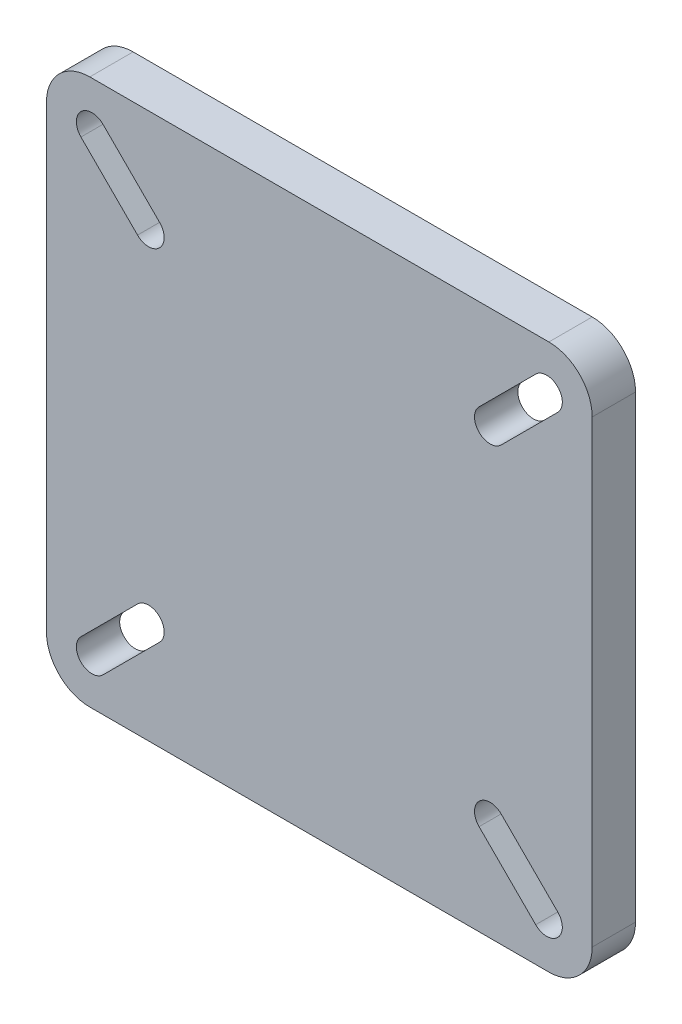
ISO-10303-21;
HEADER;
FILE_DESCRIPTION(('STEP AP214'),'2;1');
FILE_NAME('part.step','',(''),(''),'','','');
FILE_SCHEMA(('AUTOMOTIVE_DESIGN { 1 0 10303 214 1 1 1 1 }'));
ENDSEC;
DATA;
#1=APPLICATION_CONTEXT('core data for automotive mechanical design processes');
#2=APPLICATION_PROTOCOL_DEFINITION('international standard','automotive_design',2000,#1);
#3=PRODUCT_CONTEXT('',#1,'mechanical');
#4=PRODUCT('Part','Part','',(#3));
#5=PRODUCT_RELATED_PRODUCT_CATEGORY('part','',(#4));
#6=PRODUCT_DEFINITION_FORMATION('','',#4);
#7=PRODUCT_DEFINITION_CONTEXT('part definition',#1,'design');
#8=PRODUCT_DEFINITION('design','',#6,#7);
#9=PRODUCT_DEFINITION_SHAPE('','',#8);
#10=(LENGTH_UNIT() NAMED_UNIT(*) SI_UNIT(.MILLI.,.METRE.));
#11=(NAMED_UNIT(*) PLANE_ANGLE_UNIT() SI_UNIT($,.RADIAN.));
#12=(NAMED_UNIT(*) SI_UNIT($,.STERADIAN.) SOLID_ANGLE_UNIT());
#13=UNCERTAINTY_MEASURE_WITH_UNIT(LENGTH_MEASURE(1.E-05),#10,'distance_accuracy_value','');
#14=(GEOMETRIC_REPRESENTATION_CONTEXT(3) GLOBAL_UNCERTAINTY_ASSIGNED_CONTEXT((#13)) GLOBAL_UNIT_ASSIGNED_CONTEXT((#10,
#11,#12)) REPRESENTATION_CONTEXT('',''));
#15=CARTESIAN_POINT('',(0.,0.,0.));
#16=DIRECTION('',(0.,0.,1.));
#17=DIRECTION('',(1.,0.,0.));
#18=AXIS2_PLACEMENT_3D('',#15,#16,#17);
#19=CARTESIAN_POINT('',(60.,-60.,9.525));
#20=DIRECTION('',(-1.,0.,0.));
#21=DIRECTION('',(0.,0.,1.));
#22=AXIS2_PLACEMENT_3D('',#19,#20,#21);
#23=PLANE('',#22);
#24=DIRECTION('',(0.,1.,0.));
#25=VECTOR('',#24,1.);
#26=CARTESIAN_POINT('',(60.,-60.,9.525));
#27=LINE('',#26,#25);
#28=CARTESIAN_POINT('',(60.,-50.475,9.525));
#29=VERTEX_POINT('',#28);
#30=CARTESIAN_POINT('',(60.,50.475,9.525));
#31=VERTEX_POINT('',#30);
#32=EDGE_CURVE('E315',#29,#31,#27,.T.);
#33=ORIENTED_EDGE('',*,*,#32,.F.);
#34=DIRECTION('',(0.,0.,-1.));
#35=VECTOR('',#34,1.);
#36=CARTESIAN_POINT('',(60.,-50.475,9.525));
#37=LINE('',#36,#35);
#38=CARTESIAN_POINT('',(60.,-50.475,0.));
#39=VERTEX_POINT('',#38);
#40=EDGE_CURVE('E370',#29,#39,#37,.T.);
#41=ORIENTED_EDGE('',*,*,#40,.T.);
#42=DIRECTION('',(0.,1.,0.));
#43=VECTOR('',#42,1.);
#44=CARTESIAN_POINT('',(60.,-60.,0.));
#45=LINE('',#44,#43);
#46=CARTESIAN_POINT('',(60.,50.475,0.));
#47=VERTEX_POINT('',#46);
#48=EDGE_CURVE('E327',#39,#47,#45,.T.);
#49=ORIENTED_EDGE('',*,*,#48,.T.);
#50=DIRECTION('',(0.,0.,-1.));
#51=VECTOR('',#50,1.);
#52=CARTESIAN_POINT('',(60.,50.475,9.525));
#53=LINE('',#52,#51);
#54=EDGE_CURVE('E326',#47,#31,#53,.F.);
#55=ORIENTED_EDGE('',*,*,#54,.T.);
#56=EDGE_LOOP('',(#33,#41,#49,#55));
#57=FACE_BOUND('',#56,.T.);
#58=ADVANCED_FACE('F47',(#57),#23,.F.);
#59=CARTESIAN_POINT('',(-60.,60.,9.525));
#60=DIRECTION('',(0.,-1.,0.));
#61=DIRECTION('',(0.,0.,-1.));
#62=AXIS2_PLACEMENT_3D('',#59,#60,#61);
#63=PLANE('',#62);
#64=DIRECTION('',(-1.,0.,0.));
#65=VECTOR('',#64,1.);
#66=CARTESIAN_POINT('',(-60.,60.,9.525));
#67=LINE('',#66,#65);
#68=CARTESIAN_POINT('',(50.475,60.,9.525));
#69=VERTEX_POINT('',#68);
#70=CARTESIAN_POINT('',(-50.475,60.,9.525));
#71=VERTEX_POINT('',#70);
#72=EDGE_CURVE('E318',#69,#71,#67,.T.);
#73=ORIENTED_EDGE('',*,*,#72,.F.);
#74=DIRECTION('',(0.,0.,-1.));
#75=VECTOR('',#74,1.);
#76=CARTESIAN_POINT('',(50.475,60.,9.525));
#77=LINE('',#76,#75);
#78=CARTESIAN_POINT('',(50.475,60.,0.));
#79=VERTEX_POINT('',#78);
#80=EDGE_CURVE('E395',#69,#79,#77,.T.);
#81=ORIENTED_EDGE('',*,*,#80,.T.);
#82=DIRECTION('',(-1.,0.,0.));
#83=VECTOR('',#82,1.);
#84=CARTESIAN_POINT('',(-60.,60.,0.));
#85=LINE('',#84,#83);
#86=CARTESIAN_POINT('',(-50.475,60.,0.));
#87=VERTEX_POINT('',#86);
#88=EDGE_CURVE('E330',#79,#87,#85,.T.);
#89=ORIENTED_EDGE('',*,*,#88,.T.);
#90=DIRECTION('',(0.,0.,-1.));
#91=VECTOR('',#90,1.);
#92=CARTESIAN_POINT('',(-50.475,60.,9.525));
#93=LINE('',#92,#91);
#94=EDGE_CURVE('E393',#87,#71,#93,.F.);
#95=ORIENTED_EDGE('',*,*,#94,.T.);
#96=EDGE_LOOP('',(#73,#81,#89,#95));
#97=FACE_BOUND('',#96,.T.);
#98=ADVANCED_FACE('F428',(#97),#63,.F.);
#99=CARTESIAN_POINT('',(-60.,-60.,9.525));
#100=DIRECTION('',(1.,0.,0.));
#101=DIRECTION('',(0.,0.,-1.));
#102=AXIS2_PLACEMENT_3D('',#99,#100,#101);
#103=PLANE('',#102);
#104=DIRECTION('',(0.,-1.,0.));
#105=VECTOR('',#104,1.);
#106=CARTESIAN_POINT('',(-60.,-60.,0.));
#107=LINE('',#106,#105);
#108=CARTESIAN_POINT('',(-60.,50.475,0.));
#109=VERTEX_POINT('',#108);
#110=CARTESIAN_POINT('',(-60.,-50.475,0.));
#111=VERTEX_POINT('',#110);
#112=EDGE_CURVE('E334',#109,#111,#107,.T.);
#113=ORIENTED_EDGE('',*,*,#112,.T.);
#114=DIRECTION('',(0.,0.,-1.));
#115=VECTOR('',#114,1.);
#116=CARTESIAN_POINT('',(-60.,-50.475,9.525));
#117=LINE('',#116,#115);
#118=CARTESIAN_POINT('',(-60.,-50.475,9.525));
#119=VERTEX_POINT('',#118);
#120=EDGE_CURVE('E13',#111,#119,#117,.F.);
#121=ORIENTED_EDGE('',*,*,#120,.T.);
#122=DIRECTION('',(0.,-1.,0.));
#123=VECTOR('',#122,1.);
#124=CARTESIAN_POINT('',(-60.,-60.,9.525));
#125=LINE('',#124,#123);
#126=CARTESIAN_POINT('',(-60.,50.475,9.525));
#127=VERTEX_POINT('',#126);
#128=EDGE_CURVE('E321',#127,#119,#125,.T.);
#129=ORIENTED_EDGE('',*,*,#128,.F.);
#130=DIRECTION('',(0.,0.,-1.));
#131=VECTOR('',#130,1.);
#132=CARTESIAN_POINT('',(-60.,50.475,9.525));
#133=LINE('',#132,#131);
#134=EDGE_CURVE('E55',#127,#109,#133,.T.);
#135=ORIENTED_EDGE('',*,*,#134,.T.);
#136=EDGE_LOOP('',(#113,#121,#129,#135));
#137=FACE_BOUND('',#136,.T.);
#138=ADVANCED_FACE('F400',(#137),#103,.F.);
#139=CARTESIAN_POINT('',(-60.,-60.,9.525));
#140=DIRECTION('',(0.,1.,0.));
#141=DIRECTION('',(0.,0.,1.));
#142=AXIS2_PLACEMENT_3D('',#139,#140,#141);
#143=PLANE('',#142);
#144=DIRECTION('',(1.,0.,0.));
#145=VECTOR('',#144,1.);
#146=CARTESIAN_POINT('',(-60.,-60.,0.));
#147=LINE('',#146,#145);
#148=CARTESIAN_POINT('',(-50.475,-60.,0.));
#149=VERTEX_POINT('',#148);
#150=CARTESIAN_POINT('',(50.475,-60.,0.));
#151=VERTEX_POINT('',#150);
#152=EDGE_CURVE('E319',#149,#151,#147,.T.);
#153=ORIENTED_EDGE('',*,*,#152,.T.);
#154=DIRECTION('',(0.,0.,-1.));
#155=VECTOR('',#154,1.);
#156=CARTESIAN_POINT('',(50.475,-60.,9.525));
#157=LINE('',#156,#155);
#158=CARTESIAN_POINT('',(50.475,-60.,9.525));
#159=VERTEX_POINT('',#158);
#160=EDGE_CURVE('E384',#151,#159,#157,.F.);
#161=ORIENTED_EDGE('',*,*,#160,.T.);
#162=DIRECTION('',(1.,0.,0.));
#163=VECTOR('',#162,1.);
#164=CARTESIAN_POINT('',(-60.,-60.,9.525));
#165=LINE('',#164,#163);
#166=CARTESIAN_POINT('',(-50.475,-60.,9.525));
#167=VERTEX_POINT('',#166);
#168=EDGE_CURVE('E323',#167,#159,#165,.T.);
#169=ORIENTED_EDGE('',*,*,#168,.F.);
#170=DIRECTION('',(0.,0.,-1.));
#171=VECTOR('',#170,1.);
#172=CARTESIAN_POINT('',(-50.475,-60.,9.525));
#173=LINE('',#172,#171);
#174=EDGE_CURVE('E381',#167,#149,#173,.T.);
#175=ORIENTED_EDGE('',*,*,#174,.T.);
#176=EDGE_LOOP('',(#153,#161,#169,#175));
#177=FACE_BOUND('',#176,.T.);
#178=ADVANCED_FACE('F412',(#177),#143,.F.);
#179=CARTESIAN_POINT('',(0.,0.,9.525));
#180=DIRECTION('',(0.,0.,-1.));
#181=DIRECTION('',(-1.,0.,0.));
#182=AXIS2_PLACEMENT_3D('',#179,#180,#181);
#183=PLANE('',#182);
#184=DIRECTION('',(0.707106781186546,0.707106781186549,0.));
#185=VECTOR('',#184,1.);
#186=CARTESIAN_POINT('',(-47.5753308473112,-52.4246691526888,9.525));
#187=LINE('',#186,#185);
#188=CARTESIAN_POINT('',(-47.5753308473112,-52.4246691526888,9.525));
#189=VERTEX_POINT('',#188);
#190=CARTESIAN_POINT('',(-35.1253308473112,-39.9746691526888,9.525));
#191=VERTEX_POINT('',#190);
#192=EDGE_CURVE('E362',#189,#191,#187,.T.);
#193=ORIENTED_EDGE('',*,*,#192,.F.);
#194=CARTESIAN_POINT('',(-49.9999999999998,-50.0000000000002,9.525));
#195=DIRECTION('',(0.,0.,1.));
#196=DIRECTION('',(1.,0.,0.));
#197=AXIS2_PLACEMENT_3D('',#194,#195,#196);
#198=CIRCLE('',#197,3.42899999999999);
#199=CARTESIAN_POINT('',(-52.4246691526885,-47.5753308473115,9.525));
#200=VERTEX_POINT('',#199);
#201=EDGE_CURVE('E216',#200,#189,#198,.T.);
#202=ORIENTED_EDGE('',*,*,#201,.F.);
#203=DIRECTION('',(-0.707106781186544,-0.707106781186551,0.));
#204=VECTOR('',#203,1.);
#205=CARTESIAN_POINT('',(-52.4246691526885,-47.5753308473115,9.525));
#206=LINE('',#205,#204);
#207=CARTESIAN_POINT('',(-39.9746691526886,-35.1253308473115,9.525));
#208=VERTEX_POINT('',#207);
#209=EDGE_CURVE('E366',#208,#200,#206,.T.);
#210=ORIENTED_EDGE('',*,*,#209,.F.);
#211=CARTESIAN_POINT('',(-37.5499999999999,-37.5500000000001,9.525));
#212=DIRECTION('',(0.,0.,1.));
#213=DIRECTION('',(1.,0.,0.));
#214=AXIS2_PLACEMENT_3D('',#211,#212,#213);
#215=CIRCLE('',#214,3.42900000000001);
#216=EDGE_CURVE('E364',#191,#208,#215,.T.);
#217=ORIENTED_EDGE('',*,*,#216,.F.);
#218=EDGE_LOOP('',(#193,#202,#210,#217));
#219=FACE_BOUND('',#218,.T.);
#220=DIRECTION('',(-0.707106781186547,0.707106781186548,0.));
#221=VECTOR('',#220,1.);
#222=CARTESIAN_POINT('',(52.4246691526887,-47.5753308473113,9.525));
#223=LINE('',#222,#221);
#224=CARTESIAN_POINT('',(52.4246691526887,-47.5753308473113,9.525));
#225=VERTEX_POINT('',#224);
#226=CARTESIAN_POINT('',(39.9746691526887,-35.1253308473113,9.525));
#227=VERTEX_POINT('',#226);
#228=EDGE_CURVE('E353',#225,#227,#223,.T.);
#229=ORIENTED_EDGE('',*,*,#228,.F.);
#230=CARTESIAN_POINT('',(50.,-50.,9.525));
#231=DIRECTION('',(0.,0.,1.));
#232=DIRECTION('',(1.,0.,0.));
#233=AXIS2_PLACEMENT_3D('',#230,#231,#232);
#234=CIRCLE('',#233,3.42899999999999);
#235=CARTESIAN_POINT('',(47.5753308473113,-52.4246691526887,9.525));
#236=VERTEX_POINT('',#235);
#237=EDGE_CURVE('E359',#236,#225,#234,.T.);
#238=ORIENTED_EDGE('',*,*,#237,.F.);
#239=DIRECTION('',(0.707106781186548,-0.707106781186547,0.));
#240=VECTOR('',#239,1.);
#241=CARTESIAN_POINT('',(47.5753308473113,-52.4246691526887,9.525));
#242=LINE('',#241,#240);
#243=CARTESIAN_POINT('',(35.1253308473113,-39.9746691526887,9.525));
#244=VERTEX_POINT('',#243);
#245=EDGE_CURVE('E357',#244,#236,#242,.T.);
#246=ORIENTED_EDGE('',*,*,#245,.F.);
#247=CARTESIAN_POINT('',(37.55,-37.55,9.525));
#248=DIRECTION('',(0.,0.,1.));
#249=DIRECTION('',(1.,0.,0.));
#250=AXIS2_PLACEMENT_3D('',#247,#248,#249);
#251=CIRCLE('',#250,3.42900000000001);
#252=EDGE_CURVE('E355',#227,#244,#251,.T.);
#253=ORIENTED_EDGE('',*,*,#252,.F.);
#254=EDGE_LOOP('',(#229,#238,#246,#253));
#255=FACE_BOUND('',#254,.T.);
#256=DIRECTION('',(-0.707106781186541,-0.707106781186554,0.));
#257=VECTOR('',#256,1.);
#258=CARTESIAN_POINT('',(47.5753308473108,52.4246691526892,9.525));
#259=LINE('',#258,#257);
#260=CARTESIAN_POINT('',(47.5753308473108,52.4246691526892,9.525));
#261=VERTEX_POINT('',#260);
#262=CARTESIAN_POINT('',(35.1253308473109,39.974669152689,9.525));
#263=VERTEX_POINT('',#262);
#264=EDGE_CURVE('E246',#261,#263,#259,.T.);
#265=ORIENTED_EDGE('',*,*,#264,.F.);
#266=CARTESIAN_POINT('',(49.9999999999995,50.0000000000005,9.525));
#267=DIRECTION('',(0.,0.,1.));
#268=DIRECTION('',(1.,0.,0.));
#269=AXIS2_PLACEMENT_3D('',#266,#267,#268);
#270=CIRCLE('',#269,3.42899999999999);
#271=CARTESIAN_POINT('',(52.4246691526882,47.5753308473119,9.525));
#272=VERTEX_POINT('',#271);
#273=EDGE_CURVE('E350',#272,#261,#270,.T.);
#274=ORIENTED_EDGE('',*,*,#273,.F.);
#275=DIRECTION('',(0.707106781186539,0.707106781186556,0.));
#276=VECTOR('',#275,1.);
#277=CARTESIAN_POINT('',(52.4246691526882,47.5753308473119,9.525));
#278=LINE('',#277,#276);
#279=CARTESIAN_POINT('',(39.9746691526883,35.1253308473117,9.525));
#280=VERTEX_POINT('',#279);
#281=EDGE_CURVE('E348',#280,#272,#278,.T.);
#282=ORIENTED_EDGE('',*,*,#281,.F.);
#283=CARTESIAN_POINT('',(37.5499999999996,37.5500000000004,9.525));
#284=DIRECTION('',(0.,0.,1.));
#285=DIRECTION('',(1.,0.,0.));
#286=AXIS2_PLACEMENT_3D('',#283,#284,#285);
#287=CIRCLE('',#286,3.42900000000001);
#288=EDGE_CURVE('E346',#263,#280,#287,.T.);
#289=ORIENTED_EDGE('',*,*,#288,.F.);
#290=EDGE_LOOP('',(#265,#274,#282,#289));
#291=FACE_BOUND('',#290,.T.);
#292=DIRECTION('',(0.707106781186547,-0.707106781186548,0.));
#293=VECTOR('',#292,1.);
#294=CARTESIAN_POINT('',(-52.4246691526887,47.5753308473113,9.525));
#295=LINE('',#294,#293);
#296=CARTESIAN_POINT('',(-52.4246691526887,47.5753308473113,9.525));
#297=VERTEX_POINT('',#296);
#298=CARTESIAN_POINT('',(-39.9746691526887,35.1253308473113,9.525));
#299=VERTEX_POINT('',#298);
#300=EDGE_CURVE('E311',#297,#299,#295,.T.);
#301=ORIENTED_EDGE('',*,*,#300,.F.);
#302=CARTESIAN_POINT('',(-50.,50.,9.525));
#303=DIRECTION('',(0.,0.,1.));
#304=DIRECTION('',(1.,0.,0.));
#305=AXIS2_PLACEMENT_3D('',#302,#303,#304);
#306=CIRCLE('',#305,3.42899999999999);
#307=CARTESIAN_POINT('',(-47.5753308473113,52.4246691526887,9.525));
#308=VERTEX_POINT('',#307);
#309=EDGE_CURVE('E331',#308,#297,#306,.T.);
#310=ORIENTED_EDGE('',*,*,#309,.F.);
#311=DIRECTION('',(-0.707106781186548,0.707106781186547,0.));
#312=VECTOR('',#311,1.);
#313=CARTESIAN_POINT('',(-47.5753308473113,52.4246691526887,9.525));
#314=LINE('',#313,#312);
#315=CARTESIAN_POINT('',(-35.1253308473113,39.9746691526887,9.525));
#316=VERTEX_POINT('',#315);
#317=EDGE_CURVE('E341',#316,#308,#314,.T.);
#318=ORIENTED_EDGE('',*,*,#317,.F.);
#319=CARTESIAN_POINT('',(-37.55,37.55,9.525));
#320=DIRECTION('',(0.,0.,1.));
#321=DIRECTION('',(1.,0.,0.));
#322=AXIS2_PLACEMENT_3D('',#319,#320,#321);
#323=CIRCLE('',#322,3.42900000000001);
#324=EDGE_CURVE('E339',#299,#316,#323,.T.);
#325=ORIENTED_EDGE('',*,*,#324,.F.);
#326=EDGE_LOOP('',(#301,#310,#318,#325));
#327=FACE_BOUND('',#326,.T.);
#328=ORIENTED_EDGE('',*,*,#168,.T.);
#329=CARTESIAN_POINT('',(50.475,-50.475,9.525));
#330=DIRECTION('',(0.,0.,-1.));
#331=DIRECTION('',(-1.,0.,0.));
#332=AXIS2_PLACEMENT_3D('',#329,#330,#331);
#333=CIRCLE('',#332,9.525);
#334=EDGE_CURVE('E391',#159,#29,#333,.F.);
#335=ORIENTED_EDGE('',*,*,#334,.T.);
#336=ORIENTED_EDGE('',*,*,#32,.T.);
#337=CARTESIAN_POINT('',(50.475,50.475,9.525));
#338=DIRECTION('',(0.,0.,-1.));
#339=DIRECTION('',(-1.,0.,0.));
#340=AXIS2_PLACEMENT_3D('',#337,#338,#339);
#341=CIRCLE('',#340,9.525);
#342=EDGE_CURVE('E389',#31,#69,#341,.F.);
#343=ORIENTED_EDGE('',*,*,#342,.T.);
#344=ORIENTED_EDGE('',*,*,#72,.T.);
#345=CARTESIAN_POINT('',(-50.475,50.475,9.525));
#346=DIRECTION('',(0.,0.,-1.));
#347=DIRECTION('',(-1.,0.,0.));
#348=AXIS2_PLACEMENT_3D('',#345,#346,#347);
#349=CIRCLE('',#348,9.525);
#350=EDGE_CURVE('E67',#71,#127,#349,.F.);
#351=ORIENTED_EDGE('',*,*,#350,.T.);
#352=ORIENTED_EDGE('',*,*,#128,.T.);
#353=CARTESIAN_POINT('',(-50.475,-50.475,9.525));
#354=DIRECTION('',(0.,0.,-1.));
#355=DIRECTION('',(-1.,0.,0.));
#356=AXIS2_PLACEMENT_3D('',#353,#354,#355);
#357=CIRCLE('',#356,9.525);
#358=EDGE_CURVE('E387',#119,#167,#357,.F.);
#359=ORIENTED_EDGE('',*,*,#358,.T.);
#360=EDGE_LOOP('',(#328,#335,#336,#343,#344,#351,#352,#359));
#361=FACE_BOUND('',#360,.T.);
#362=ADVANCED_FACE('F415',(#219,#255,#291,#327,#361),#183,.F.);
#363=CARTESIAN_POINT('',(0.,0.,0.));
#364=DIRECTION('',(0.,0.,-1.));
#365=DIRECTION('',(-1.,0.,0.));
#366=AXIS2_PLACEMENT_3D('',#363,#364,#365);
#367=PLANE('',#366);
#368=CARTESIAN_POINT('',(-49.9999999999998,-50.0000000000002,0.));
#369=DIRECTION('',(0.,0.,1.));
#370=DIRECTION('',(0.,1.,0.));
#371=AXIS2_PLACEMENT_3D('',#368,#369,#370);
#372=CIRCLE('',#371,3.42899999999999);
#373=CARTESIAN_POINT('',(-52.4246691526885,-47.5753308473115,0.));
#374=VERTEX_POINT('',#373);
#375=CARTESIAN_POINT('',(-47.5753308473112,-52.4246691526888,0.));
#376=VERTEX_POINT('',#375);
#377=EDGE_CURVE('E213',#374,#376,#372,.T.);
#378=ORIENTED_EDGE('',*,*,#377,.T.);
#379=DIRECTION('',(0.707106781186546,0.707106781186549,0.));
#380=VECTOR('',#379,1.);
#381=CARTESIAN_POINT('',(-47.5753308473112,-52.4246691526888,0.));
#382=LINE('',#381,#380);
#383=CARTESIAN_POINT('',(-35.1253308473112,-39.9746691526888,0.));
#384=VERTEX_POINT('',#383);
#385=EDGE_CURVE('E224',#376,#384,#382,.T.);
#386=ORIENTED_EDGE('',*,*,#385,.T.);
#387=CARTESIAN_POINT('',(-37.5499999999999,-37.5500000000001,0.));
#388=DIRECTION('',(0.,0.,1.));
#389=DIRECTION('',(0.,1.,0.));
#390=AXIS2_PLACEMENT_3D('',#387,#388,#389);
#391=CIRCLE('',#390,3.42900000000001);
#392=CARTESIAN_POINT('',(-39.9746691526886,-35.1253308473115,0.));
#393=VERTEX_POINT('',#392);
#394=EDGE_CURVE('E229',#384,#393,#391,.T.);
#395=ORIENTED_EDGE('',*,*,#394,.T.);
#396=DIRECTION('',(-0.707106781186544,-0.707106781186551,0.));
#397=VECTOR('',#396,1.);
#398=CARTESIAN_POINT('',(-52.4246691526885,-47.5753308473115,0.));
#399=LINE('',#398,#397);
#400=EDGE_CURVE('E220',#393,#374,#399,.T.);
#401=ORIENTED_EDGE('',*,*,#400,.T.);
#402=EDGE_LOOP('',(#378,#386,#395,#401));
#403=FACE_BOUND('',#402,.T.);
#404=CARTESIAN_POINT('',(50.,-50.,0.));
#405=DIRECTION('',(0.,0.,1.));
#406=DIRECTION('',(-1.,0.,0.));
#407=AXIS2_PLACEMENT_3D('',#404,#405,#406);
#408=CIRCLE('',#407,3.42899999999999);
#409=CARTESIAN_POINT('',(47.5753308473113,-52.4246691526887,0.));
#410=VERTEX_POINT('',#409);
#411=CARTESIAN_POINT('',(52.4246691526887,-47.5753308473113,0.));
#412=VERTEX_POINT('',#411);
#413=EDGE_CURVE('E249',#410,#412,#408,.T.);
#414=ORIENTED_EDGE('',*,*,#413,.T.);
#415=DIRECTION('',(-0.707106781186547,0.707106781186548,0.));
#416=VECTOR('',#415,1.);
#417=CARTESIAN_POINT('',(52.4246691526887,-47.5753308473113,0.));
#418=LINE('',#417,#416);
#419=CARTESIAN_POINT('',(39.9746691526887,-35.1253308473113,0.));
#420=VERTEX_POINT('',#419);
#421=EDGE_CURVE('E252',#412,#420,#418,.T.);
#422=ORIENTED_EDGE('',*,*,#421,.T.);
#423=CARTESIAN_POINT('',(37.55,-37.55,0.));
#424=DIRECTION('',(0.,0.,1.));
#425=DIRECTION('',(-1.,0.,0.));
#426=AXIS2_PLACEMENT_3D('',#423,#424,#425);
#427=CIRCLE('',#426,3.42900000000001);
#428=CARTESIAN_POINT('',(35.1253308473113,-39.9746691526887,0.));
#429=VERTEX_POINT('',#428);
#430=EDGE_CURVE('E256',#420,#429,#427,.T.);
#431=ORIENTED_EDGE('',*,*,#430,.T.);
#432=DIRECTION('',(0.707106781186548,-0.707106781186547,0.));
#433=VECTOR('',#432,1.);
#434=CARTESIAN_POINT('',(47.5753308473113,-52.4246691526887,0.));
#435=LINE('',#434,#433);
#436=EDGE_CURVE('E259',#429,#410,#435,.T.);
#437=ORIENTED_EDGE('',*,*,#436,.T.);
#438=EDGE_LOOP('',(#414,#422,#431,#437));
#439=FACE_BOUND('',#438,.T.);
#440=CARTESIAN_POINT('',(49.9999999999995,50.0000000000005,0.));
#441=DIRECTION('',(0.,0.,1.));
#442=DIRECTION('',(0.,-1.,0.));
#443=AXIS2_PLACEMENT_3D('',#440,#441,#442);
#444=CIRCLE('',#443,3.42899999999999);
#445=CARTESIAN_POINT('',(52.4246691526882,47.5753308473119,0.));
#446=VERTEX_POINT('',#445);
#447=CARTESIAN_POINT('',(47.5753308473108,52.4246691526892,0.));
#448=VERTEX_POINT('',#447);
#449=EDGE_CURVE('E269',#446,#448,#444,.T.);
#450=ORIENTED_EDGE('',*,*,#449,.T.);
#451=DIRECTION('',(-0.707106781186541,-0.707106781186554,0.));
#452=VECTOR('',#451,1.);
#453=CARTESIAN_POINT('',(47.5753308473108,52.4246691526892,0.));
#454=LINE('',#453,#452);
#455=CARTESIAN_POINT('',(35.1253308473109,39.9746691526891,0.));
#456=VERTEX_POINT('',#455);
#457=EDGE_CURVE('E272',#448,#456,#454,.T.);
#458=ORIENTED_EDGE('',*,*,#457,.T.);
#459=CARTESIAN_POINT('',(37.5499999999996,37.5500000000004,0.));
#460=DIRECTION('',(0.,0.,1.));
#461=DIRECTION('',(0.,-1.,0.));
#462=AXIS2_PLACEMENT_3D('',#459,#460,#461);
#463=CIRCLE('',#462,3.42900000000001);
#464=CARTESIAN_POINT('',(39.9746691526883,35.1253308473117,0.));
#465=VERTEX_POINT('',#464);
#466=EDGE_CURVE('E275',#456,#465,#463,.T.);
#467=ORIENTED_EDGE('',*,*,#466,.T.);
#468=DIRECTION('',(0.707106781186539,0.707106781186556,0.));
#469=VECTOR('',#468,1.);
#470=CARTESIAN_POINT('',(52.4246691526882,47.5753308473119,0.));
#471=LINE('',#470,#469);
#472=EDGE_CURVE('E278',#465,#446,#471,.T.);
#473=ORIENTED_EDGE('',*,*,#472,.T.);
#474=EDGE_LOOP('',(#450,#458,#467,#473));
#475=FACE_BOUND('',#474,.T.);
#476=CARTESIAN_POINT('',(-50.,50.,0.));
#477=DIRECTION('',(0.,0.,1.));
#478=DIRECTION('',(1.,0.,0.));
#479=AXIS2_PLACEMENT_3D('',#476,#477,#478);
#480=CIRCLE('',#479,3.42899999999999);
#481=CARTESIAN_POINT('',(-47.5753308473113,52.4246691526887,0.));
#482=VERTEX_POINT('',#481);
#483=CARTESIAN_POINT('',(-52.4246691526887,47.5753308473113,0.));
#484=VERTEX_POINT('',#483);
#485=EDGE_CURVE('E291',#482,#484,#480,.T.);
#486=ORIENTED_EDGE('',*,*,#485,.T.);
#487=DIRECTION('',(0.707106781186547,-0.707106781186548,0.));
#488=VECTOR('',#487,1.);
#489=CARTESIAN_POINT('',(-52.4246691526887,47.5753308473113,0.));
#490=LINE('',#489,#488);
#491=CARTESIAN_POINT('',(-39.9746691526887,35.1253308473113,0.));
#492=VERTEX_POINT('',#491);
#493=EDGE_CURVE('E294',#484,#492,#490,.T.);
#494=ORIENTED_EDGE('',*,*,#493,.T.);
#495=CARTESIAN_POINT('',(-37.55,37.55,0.));
#496=DIRECTION('',(0.,0.,1.));
#497=DIRECTION('',(1.,0.,0.));
#498=AXIS2_PLACEMENT_3D('',#495,#496,#497);
#499=CIRCLE('',#498,3.42900000000001);
#500=CARTESIAN_POINT('',(-35.1253308473113,39.9746691526887,0.));
#501=VERTEX_POINT('',#500);
#502=EDGE_CURVE('E297',#492,#501,#499,.T.);
#503=ORIENTED_EDGE('',*,*,#502,.T.);
#504=DIRECTION('',(-0.707106781186548,0.707106781186547,0.));
#505=VECTOR('',#504,1.);
#506=CARTESIAN_POINT('',(-47.5753308473113,52.4246691526887,0.));
#507=LINE('',#506,#505);
#508=EDGE_CURVE('E300',#501,#482,#507,.T.);
#509=ORIENTED_EDGE('',*,*,#508,.T.);
#510=EDGE_LOOP('',(#486,#494,#503,#509));
#511=FACE_BOUND('',#510,.T.);
#512=ORIENTED_EDGE('',*,*,#48,.F.);
#513=CARTESIAN_POINT('',(50.475,-50.475,0.));
#514=DIRECTION('',(0.,0.,-1.));
#515=DIRECTION('',(-1.,0.,0.));
#516=AXIS2_PLACEMENT_3D('',#513,#514,#515);
#517=CIRCLE('',#516,9.525);
#518=EDGE_CURVE('E379',#39,#151,#517,.T.);
#519=ORIENTED_EDGE('',*,*,#518,.T.);
#520=ORIENTED_EDGE('',*,*,#152,.F.);
#521=CARTESIAN_POINT('',(-50.475,-50.475,0.));
#522=DIRECTION('',(0.,0.,-1.));
#523=DIRECTION('',(-1.,0.,0.));
#524=AXIS2_PLACEMENT_3D('',#521,#522,#523);
#525=CIRCLE('',#524,9.525);
#526=EDGE_CURVE('E375',#149,#111,#525,.T.);
#527=ORIENTED_EDGE('',*,*,#526,.T.);
#528=ORIENTED_EDGE('',*,*,#112,.F.);
#529=CARTESIAN_POINT('',(-50.475,50.475,0.));
#530=DIRECTION('',(0.,0.,-1.));
#531=DIRECTION('',(-1.,0.,0.));
#532=AXIS2_PLACEMENT_3D('',#529,#530,#531);
#533=CIRCLE('',#532,9.525);
#534=EDGE_CURVE('E373',#109,#87,#533,.T.);
#535=ORIENTED_EDGE('',*,*,#534,.T.);
#536=ORIENTED_EDGE('',*,*,#88,.F.);
#537=CARTESIAN_POINT('',(50.475,50.475,0.));
#538=DIRECTION('',(0.,0.,-1.));
#539=DIRECTION('',(-1.,0.,0.));
#540=AXIS2_PLACEMENT_3D('',#537,#538,#539);
#541=CIRCLE('',#540,9.525);
#542=EDGE_CURVE('E377',#79,#47,#541,.T.);
#543=ORIENTED_EDGE('',*,*,#542,.T.);
#544=EDGE_LOOP('',(#512,#519,#520,#527,#528,#535,#536,#543));
#545=FACE_BOUND('',#544,.T.);
#546=ADVANCED_FACE('F231',(#403,#439,#475,#511,#545),#367,.T.);
#547=CARTESIAN_POINT('',(-50.,50.,0.));
#548=DIRECTION('',(0.,0.,1.));
#549=DIRECTION('',(1.,0.,0.));
#550=AXIS2_PLACEMENT_3D('',#547,#548,#549);
#551=CYLINDRICAL_SURFACE('',#550,3.42899999999999);
#552=DIRECTION('',(0.,0.,1.));
#553=VECTOR('',#552,1.);
#554=CARTESIAN_POINT('',(-52.4246691526887,47.5753308473113,0.));
#555=LINE('',#554,#553);
#556=EDGE_CURVE('E303',#484,#297,#555,.T.);
#557=ORIENTED_EDGE('',*,*,#556,.F.);
#558=ORIENTED_EDGE('',*,*,#485,.F.);
#559=DIRECTION('',(0.,0.,1.));
#560=VECTOR('',#559,1.);
#561=CARTESIAN_POINT('',(-47.5753308473113,52.4246691526887,0.));
#562=LINE('',#561,#560);
#563=EDGE_CURVE('E307',#482,#308,#562,.T.);
#564=ORIENTED_EDGE('',*,*,#563,.T.);
#565=ORIENTED_EDGE('',*,*,#309,.T.);
#566=EDGE_LOOP('',(#557,#558,#564,#565));
#567=FACE_BOUND('',#566,.T.);
#568=ADVANCED_FACE('F597',(#567),#551,.F.);
#569=CARTESIAN_POINT('',(-47.5753308473113,52.4246691526887,0.));
#570=DIRECTION('',(0.707106781186547,0.707106781186548,0.));
#571=DIRECTION('',(-0.707106781186548,0.707106781186547,0.));
#572=AXIS2_PLACEMENT_3D('',#569,#570,#571);
#573=PLANE('',#572);
#574=ORIENTED_EDGE('',*,*,#563,.F.);
#575=ORIENTED_EDGE('',*,*,#508,.F.);
#576=DIRECTION('',(0.,0.,1.));
#577=VECTOR('',#576,1.);
#578=CARTESIAN_POINT('',(-35.1253308473113,39.9746691526887,0.));
#579=LINE('',#578,#577);
#580=EDGE_CURVE('E304',#501,#316,#579,.T.);
#581=ORIENTED_EDGE('',*,*,#580,.T.);
#582=ORIENTED_EDGE('',*,*,#317,.T.);
#583=EDGE_LOOP('',(#574,#575,#581,#582));
#584=FACE_BOUND('',#583,.T.);
#585=ADVANCED_FACE('F588',(#584),#573,.F.);
#586=CARTESIAN_POINT('',(-37.55,37.55,0.));
#587=DIRECTION('',(0.,0.,1.));
#588=DIRECTION('',(1.,0.,0.));
#589=AXIS2_PLACEMENT_3D('',#586,#587,#588);
#590=CYLINDRICAL_SURFACE('',#589,3.42900000000001);
#591=ORIENTED_EDGE('',*,*,#580,.F.);
#592=ORIENTED_EDGE('',*,*,#502,.F.);
#593=DIRECTION('',(0.,0.,1.));
#594=VECTOR('',#593,1.);
#595=CARTESIAN_POINT('',(-39.9746691526887,35.1253308473113,0.));
#596=LINE('',#595,#594);
#597=EDGE_CURVE('E308',#492,#299,#596,.T.);
#598=ORIENTED_EDGE('',*,*,#597,.T.);
#599=ORIENTED_EDGE('',*,*,#324,.T.);
#600=EDGE_LOOP('',(#591,#592,#598,#599));
#601=FACE_BOUND('',#600,.T.);
#602=ADVANCED_FACE('F579',(#601),#590,.F.);
#603=CARTESIAN_POINT('',(-52.4246691526887,47.5753308473113,0.));
#604=DIRECTION('',(-0.707106781186548,-0.707106781186547,0.));
#605=DIRECTION('',(0.707106781186547,-0.707106781186548,0.));
#606=AXIS2_PLACEMENT_3D('',#603,#604,#605);
#607=PLANE('',#606);
#608=ORIENTED_EDGE('',*,*,#597,.F.);
#609=ORIENTED_EDGE('',*,*,#493,.F.);
#610=ORIENTED_EDGE('',*,*,#556,.T.);
#611=ORIENTED_EDGE('',*,*,#300,.T.);
#612=EDGE_LOOP('',(#608,#609,#610,#611));
#613=FACE_BOUND('',#612,.T.);
#614=ADVANCED_FACE('F570',(#613),#607,.F.);
#615=CARTESIAN_POINT('',(49.9999999999995,50.0000000000005,0.));
#616=DIRECTION('',(0.,0.,1.));
#617=DIRECTION('',(1.,0.,0.));
#618=AXIS2_PLACEMENT_3D('',#615,#616,#617);
#619=CYLINDRICAL_SURFACE('',#618,3.42899999999999);
#620=DIRECTION('',(0.,0.,1.));
#621=VECTOR('',#620,1.);
#622=CARTESIAN_POINT('',(47.5753308473108,52.4246691526892,0.));
#623=LINE('',#622,#621);
#624=EDGE_CURVE('E281',#448,#261,#623,.T.);
#625=ORIENTED_EDGE('',*,*,#624,.F.);
#626=ORIENTED_EDGE('',*,*,#449,.F.);
#627=DIRECTION('',(0.,0.,1.));
#628=VECTOR('',#627,1.);
#629=CARTESIAN_POINT('',(52.4246691526882,47.5753308473119,0.));
#630=LINE('',#629,#628);
#631=EDGE_CURVE('E253',#446,#272,#630,.T.);
#632=ORIENTED_EDGE('',*,*,#631,.T.);
#633=ORIENTED_EDGE('',*,*,#273,.T.);
#634=EDGE_LOOP('',(#625,#626,#632,#633));
#635=FACE_BOUND('',#634,.T.);
#636=ADVANCED_FACE('F561',(#635),#619,.F.);
#637=CARTESIAN_POINT('',(52.4246691526882,47.5753308473119,0.));
#638=DIRECTION('',(0.707106781186556,-0.707106781186539,0.));
#639=DIRECTION('',(0.707106781186539,0.707106781186556,0.));
#640=AXIS2_PLACEMENT_3D('',#637,#638,#639);
#641=PLANE('',#640);
#642=ORIENTED_EDGE('',*,*,#631,.F.);
#643=ORIENTED_EDGE('',*,*,#472,.F.);
#644=DIRECTION('',(0.,0.,1.));
#645=VECTOR('',#644,1.);
#646=CARTESIAN_POINT('',(39.9746691526883,35.1253308473117,0.));
#647=LINE('',#646,#645);
#648=EDGE_CURVE('E282',#465,#280,#647,.T.);
#649=ORIENTED_EDGE('',*,*,#648,.T.);
#650=ORIENTED_EDGE('',*,*,#281,.T.);
#651=EDGE_LOOP('',(#642,#643,#649,#650));
#652=FACE_BOUND('',#651,.T.);
#653=ADVANCED_FACE('F552',(#652),#641,.F.);
#654=CARTESIAN_POINT('',(37.5499999999996,37.5500000000004,0.));
#655=DIRECTION('',(0.,0.,1.));
#656=DIRECTION('',(1.,0.,0.));
#657=AXIS2_PLACEMENT_3D('',#654,#655,#656);
#658=CYLINDRICAL_SURFACE('',#657,3.42900000000001);
#659=ORIENTED_EDGE('',*,*,#648,.F.);
#660=ORIENTED_EDGE('',*,*,#466,.F.);
#661=DIRECTION('',(0.,0.,1.));
#662=VECTOR('',#661,1.);
#663=CARTESIAN_POINT('',(35.1253308473109,39.9746691526891,0.));
#664=LINE('',#663,#662);
#665=EDGE_CURVE('E285',#456,#263,#664,.T.);
#666=ORIENTED_EDGE('',*,*,#665,.T.);
#667=ORIENTED_EDGE('',*,*,#288,.T.);
#668=EDGE_LOOP('',(#659,#660,#666,#667));
#669=FACE_BOUND('',#668,.T.);
#670=ADVANCED_FACE('F543',(#669),#658,.F.);
#671=CARTESIAN_POINT('',(47.5753308473108,52.4246691526892,0.));
#672=DIRECTION('',(-0.707106781186554,0.707106781186541,0.));
#673=DIRECTION('',(-0.707106781186541,-0.707106781186554,0.));
#674=AXIS2_PLACEMENT_3D('',#671,#672,#673);
#675=PLANE('',#674);
#676=ORIENTED_EDGE('',*,*,#665,.F.);
#677=ORIENTED_EDGE('',*,*,#457,.F.);
#678=ORIENTED_EDGE('',*,*,#624,.T.);
#679=ORIENTED_EDGE('',*,*,#264,.T.);
#680=EDGE_LOOP('',(#676,#677,#678,#679));
#681=FACE_BOUND('',#680,.T.);
#682=ADVANCED_FACE('F534',(#681),#675,.F.);
#683=CARTESIAN_POINT('',(50.,-50.,0.));
#684=DIRECTION('',(0.,0.,1.));
#685=DIRECTION('',(1.,0.,0.));
#686=AXIS2_PLACEMENT_3D('',#683,#684,#685);
#687=CYLINDRICAL_SURFACE('',#686,3.42899999999999);
#688=DIRECTION('',(0.,0.,1.));
#689=VECTOR('',#688,1.);
#690=CARTESIAN_POINT('',(52.4246691526887,-47.5753308473113,0.));
#691=LINE('',#690,#689);
#692=EDGE_CURVE('E262',#412,#225,#691,.T.);
#693=ORIENTED_EDGE('',*,*,#692,.F.);
#694=ORIENTED_EDGE('',*,*,#413,.F.);
#695=DIRECTION('',(0.,0.,1.));
#696=VECTOR('',#695,1.);
#697=CARTESIAN_POINT('',(47.5753308473113,-52.4246691526887,0.));
#698=LINE('',#697,#696);
#699=EDGE_CURVE('E234',#410,#236,#698,.T.);
#700=ORIENTED_EDGE('',*,*,#699,.T.);
#701=ORIENTED_EDGE('',*,*,#237,.T.);
#702=EDGE_LOOP('',(#693,#694,#700,#701));
#703=FACE_BOUND('',#702,.T.);
#704=ADVANCED_FACE('F525',(#703),#687,.F.);
#705=CARTESIAN_POINT('',(47.5753308473113,-52.4246691526887,0.));
#706=DIRECTION('',(-0.707106781186547,-0.707106781186548,0.));
#707=DIRECTION('',(0.707106781186548,-0.707106781186547,0.));
#708=AXIS2_PLACEMENT_3D('',#705,#706,#707);
#709=PLANE('',#708);
#710=ORIENTED_EDGE('',*,*,#699,.F.);
#711=ORIENTED_EDGE('',*,*,#436,.F.);
#712=DIRECTION('',(0.,0.,1.));
#713=VECTOR('',#712,1.);
#714=CARTESIAN_POINT('',(35.1253308473113,-39.9746691526887,0.));
#715=LINE('',#714,#713);
#716=EDGE_CURVE('E237',#429,#244,#715,.T.);
#717=ORIENTED_EDGE('',*,*,#716,.T.);
#718=ORIENTED_EDGE('',*,*,#245,.T.);
#719=EDGE_LOOP('',(#710,#711,#717,#718));
#720=FACE_BOUND('',#719,.T.);
#721=ADVANCED_FACE('F516',(#720),#709,.F.);
#722=CARTESIAN_POINT('',(37.55,-37.55,0.));
#723=DIRECTION('',(0.,0.,1.));
#724=DIRECTION('',(1.,0.,0.));
#725=AXIS2_PLACEMENT_3D('',#722,#723,#724);
#726=CYLINDRICAL_SURFACE('',#725,3.42900000000001);
#727=ORIENTED_EDGE('',*,*,#716,.F.);
#728=ORIENTED_EDGE('',*,*,#430,.F.);
#729=DIRECTION('',(0.,0.,1.));
#730=VECTOR('',#729,1.);
#731=CARTESIAN_POINT('',(39.9746691526887,-35.1253308473113,0.));
#732=LINE('',#731,#730);
#733=EDGE_CURVE('E264',#420,#227,#732,.T.);
#734=ORIENTED_EDGE('',*,*,#733,.T.);
#735=ORIENTED_EDGE('',*,*,#252,.T.);
#736=EDGE_LOOP('',(#727,#728,#734,#735));
#737=FACE_BOUND('',#736,.T.);
#738=ADVANCED_FACE('F507',(#737),#726,.F.);
#739=CARTESIAN_POINT('',(52.4246691526887,-47.5753308473113,0.));
#740=DIRECTION('',(0.707106781186548,0.707106781186547,0.));
#741=DIRECTION('',(-0.707106781186547,0.707106781186548,0.));
#742=AXIS2_PLACEMENT_3D('',#739,#740,#741);
#743=PLANE('',#742);
#744=ORIENTED_EDGE('',*,*,#733,.F.);
#745=ORIENTED_EDGE('',*,*,#421,.F.);
#746=ORIENTED_EDGE('',*,*,#692,.T.);
#747=ORIENTED_EDGE('',*,*,#228,.T.);
#748=EDGE_LOOP('',(#744,#745,#746,#747));
#749=FACE_BOUND('',#748,.T.);
#750=ADVANCED_FACE('F499',(#749),#743,.F.);
#751=CARTESIAN_POINT('',(-49.9999999999998,-50.0000000000002,0.));
#752=DIRECTION('',(0.,0.,1.));
#753=DIRECTION('',(1.,0.,0.));
#754=AXIS2_PLACEMENT_3D('',#751,#752,#753);
#755=CYLINDRICAL_SURFACE('',#754,3.42899999999999);
#756=DIRECTION('',(0.,0.,1.));
#757=VECTOR('',#756,1.);
#758=CARTESIAN_POINT('',(-47.5753308473112,-52.4246691526888,0.));
#759=LINE('',#758,#757);
#760=EDGE_CURVE('E208',#376,#189,#759,.T.);
#761=ORIENTED_EDGE('',*,*,#760,.F.);
#762=ORIENTED_EDGE('',*,*,#377,.F.);
#763=DIRECTION('',(0.,0.,1.));
#764=VECTOR('',#763,1.);
#765=CARTESIAN_POINT('',(-52.4246691526885,-47.5753308473115,0.));
#766=LINE('',#765,#764);
#767=EDGE_CURVE('E245',#374,#200,#766,.T.);
#768=ORIENTED_EDGE('',*,*,#767,.T.);
#769=ORIENTED_EDGE('',*,*,#201,.T.);
#770=EDGE_LOOP('',(#761,#762,#768,#769));
#771=FACE_BOUND('',#770,.T.);
#772=ADVANCED_FACE('F210',(#771),#755,.F.);
#773=CARTESIAN_POINT('',(-52.4246691526885,-47.5753308473115,0.));
#774=DIRECTION('',(-0.707106781186551,0.707106781186544,0.));
#775=DIRECTION('',(-0.707106781186544,-0.707106781186551,0.));
#776=AXIS2_PLACEMENT_3D('',#773,#774,#775);
#777=PLANE('',#776);
#778=ORIENTED_EDGE('',*,*,#767,.F.);
#779=ORIENTED_EDGE('',*,*,#400,.F.);
#780=DIRECTION('',(0.,0.,1.));
#781=VECTOR('',#780,1.);
#782=CARTESIAN_POINT('',(-39.9746691526886,-35.1253308473115,0.));
#783=LINE('',#782,#781);
#784=EDGE_CURVE('E242',#393,#208,#783,.T.);
#785=ORIENTED_EDGE('',*,*,#784,.T.);
#786=ORIENTED_EDGE('',*,*,#209,.T.);
#787=EDGE_LOOP('',(#778,#779,#785,#786));
#788=FACE_BOUND('',#787,.T.);
#789=ADVANCED_FACE('F482',(#788),#777,.F.);
#790=CARTESIAN_POINT('',(-37.5499999999999,-37.5500000000001,0.));
#791=DIRECTION('',(0.,0.,1.));
#792=DIRECTION('',(1.,0.,0.));
#793=AXIS2_PLACEMENT_3D('',#790,#791,#792);
#794=CYLINDRICAL_SURFACE('',#793,3.42900000000001);
#795=ORIENTED_EDGE('',*,*,#784,.F.);
#796=ORIENTED_EDGE('',*,*,#394,.F.);
#797=DIRECTION('',(0.,0.,1.));
#798=VECTOR('',#797,1.);
#799=CARTESIAN_POINT('',(-35.1253308473112,-39.9746691526888,0.));
#800=LINE('',#799,#798);
#801=EDGE_CURVE('E219',#384,#191,#800,.T.);
#802=ORIENTED_EDGE('',*,*,#801,.T.);
#803=ORIENTED_EDGE('',*,*,#216,.T.);
#804=EDGE_LOOP('',(#795,#796,#802,#803));
#805=FACE_BOUND('',#804,.T.);
#806=ADVANCED_FACE('F474',(#805),#794,.F.);
#807=CARTESIAN_POINT('',(-47.5753308473112,-52.4246691526888,0.));
#808=DIRECTION('',(0.707106781186549,-0.707106781186546,0.));
#809=DIRECTION('',(0.707106781186546,0.707106781186549,0.));
#810=AXIS2_PLACEMENT_3D('',#807,#808,#809);
#811=PLANE('',#810);
#812=ORIENTED_EDGE('',*,*,#801,.F.);
#813=ORIENTED_EDGE('',*,*,#385,.F.);
#814=ORIENTED_EDGE('',*,*,#760,.T.);
#815=ORIENTED_EDGE('',*,*,#192,.T.);
#816=EDGE_LOOP('',(#812,#813,#814,#815));
#817=FACE_BOUND('',#816,.T.);
#818=ADVANCED_FACE('F225',(#817),#811,.F.);
#819=CARTESIAN_POINT('',(50.475,-50.475,9.525));
#820=DIRECTION('',(0.,0.,-1.));
#821=DIRECTION('',(-1.,0.,0.));
#822=AXIS2_PLACEMENT_3D('',#819,#820,#821);
#823=CYLINDRICAL_SURFACE('',#822,9.525);
#824=ORIENTED_EDGE('',*,*,#334,.F.);
#825=ORIENTED_EDGE('',*,*,#160,.F.);
#826=ORIENTED_EDGE('',*,*,#518,.F.);
#827=ORIENTED_EDGE('',*,*,#40,.F.);
#828=EDGE_LOOP('',(#824,#825,#826,#827));
#829=FACE_BOUND('',#828,.T.);
#830=ADVANCED_FACE('F419',(#829),#823,.T.);
#831=CARTESIAN_POINT('',(50.475,50.475,9.525));
#832=DIRECTION('',(0.,0.,-1.));
#833=DIRECTION('',(-1.,0.,0.));
#834=AXIS2_PLACEMENT_3D('',#831,#832,#833);
#835=CYLINDRICAL_SURFACE('',#834,9.525);
#836=ORIENTED_EDGE('',*,*,#342,.F.);
#837=ORIENTED_EDGE('',*,*,#54,.F.);
#838=ORIENTED_EDGE('',*,*,#542,.F.);
#839=ORIENTED_EDGE('',*,*,#80,.F.);
#840=EDGE_LOOP('',(#836,#837,#838,#839));
#841=FACE_BOUND('',#840,.T.);
#842=ADVANCED_FACE('F425',(#841),#835,.T.);
#843=CARTESIAN_POINT('',(-50.475,-50.475,9.525));
#844=DIRECTION('',(0.,0.,-1.));
#845=DIRECTION('',(-1.,0.,0.));
#846=AXIS2_PLACEMENT_3D('',#843,#844,#845);
#847=CYLINDRICAL_SURFACE('',#846,9.525);
#848=ORIENTED_EDGE('',*,*,#358,.F.);
#849=ORIENTED_EDGE('',*,*,#120,.F.);
#850=ORIENTED_EDGE('',*,*,#526,.F.);
#851=ORIENTED_EDGE('',*,*,#174,.F.);
#852=EDGE_LOOP('',(#848,#849,#850,#851));
#853=FACE_BOUND('',#852,.T.);
#854=ADVANCED_FACE('F409',(#853),#847,.T.);
#855=CARTESIAN_POINT('',(-50.475,50.475,9.525));
#856=DIRECTION('',(0.,0.,-1.));
#857=DIRECTION('',(-1.,0.,0.));
#858=AXIS2_PLACEMENT_3D('',#855,#856,#857);
#859=CYLINDRICAL_SURFACE('',#858,9.525);
#860=ORIENTED_EDGE('',*,*,#350,.F.);
#861=ORIENTED_EDGE('',*,*,#94,.F.);
#862=ORIENTED_EDGE('',*,*,#534,.F.);
#863=ORIENTED_EDGE('',*,*,#134,.F.);
#864=EDGE_LOOP('',(#860,#861,#862,#863));
#865=FACE_BOUND('',#864,.T.);
#866=ADVANCED_FACE('F49',(#865),#859,.T.);
#867=CLOSED_SHELL('',(#58,#98,#138,#178,#362,#546,#568,#585,#602,#614,#636,#653,#670,#682,#704,
#721,#738,#750,#772,#789,#806,#818,#830,#842,#854,#866));
#868=MANIFOLD_SOLID_BREP('B2',#867);
#869=ADVANCED_BREP_SHAPE_REPRESENTATION('',(#18,#868),#14);
#870=SHAPE_DEFINITION_REPRESENTATION(#9,#869);
ENDSEC;
END-ISO-10303-21;
